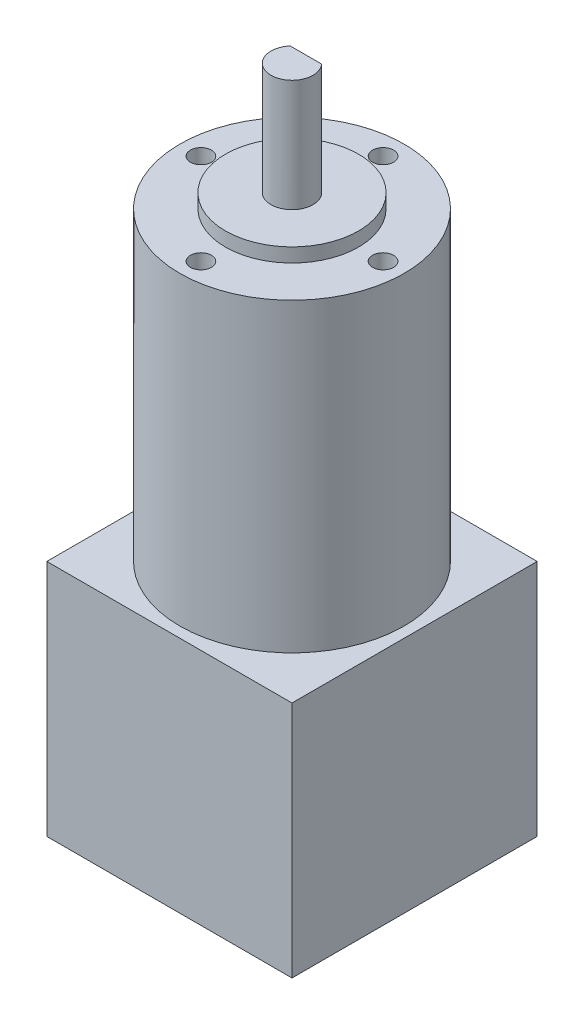
ISO-10303-21;
HEADER;
FILE_DESCRIPTION(('STEP AP214'),'2;1');
FILE_NAME('part.step','',(''),(''),'','','');
FILE_SCHEMA(('AUTOMOTIVE_DESIGN { 1 0 10303 214 1 1 1 1 }'));
ENDSEC;
DATA;
#1=APPLICATION_CONTEXT('core data for automotive mechanical design processes');
#2=APPLICATION_PROTOCOL_DEFINITION('international standard','automotive_design',2000,#1);
#3=PRODUCT_CONTEXT('',#1,'mechanical');
#4=PRODUCT('Part','Part','',(#3));
#5=PRODUCT_RELATED_PRODUCT_CATEGORY('part','',(#4));
#6=PRODUCT_DEFINITION_FORMATION('','',#4);
#7=PRODUCT_DEFINITION_CONTEXT('part definition',#1,'design');
#8=PRODUCT_DEFINITION('design','',#6,#7);
#9=PRODUCT_DEFINITION_SHAPE('','',#8);
#10=(LENGTH_UNIT() NAMED_UNIT(*) SI_UNIT(.MILLI.,.METRE.));
#11=(NAMED_UNIT(*) PLANE_ANGLE_UNIT() SI_UNIT($,.RADIAN.));
#12=(NAMED_UNIT(*) SI_UNIT($,.STERADIAN.) SOLID_ANGLE_UNIT());
#13=UNCERTAINTY_MEASURE_WITH_UNIT(LENGTH_MEASURE(1.E-05),#10,'distance_accuracy_value','');
#14=(GEOMETRIC_REPRESENTATION_CONTEXT(3) GLOBAL_UNCERTAINTY_ASSIGNED_CONTEXT((#13)) GLOBAL_UNIT_ASSIGNED_CONTEXT((#10,
#11,#12)) REPRESENTATION_CONTEXT('',''));
#15=CARTESIAN_POINT('',(0.,0.,0.));
#16=DIRECTION('',(0.,0.,1.));
#17=DIRECTION('',(1.,0.,0.));
#18=AXIS2_PLACEMENT_3D('',#15,#16,#17);
#19=CARTESIAN_POINT('',(17.5,34.,17.5));
#20=DIRECTION('',(-1.,0.,0.));
#21=DIRECTION('',(0.,0.,1.));
#22=AXIS2_PLACEMENT_3D('',#19,#20,#21);
#23=PLANE('',#22);
#24=DIRECTION('',(0.,0.,-1.));
#25=VECTOR('',#24,1.);
#26=CARTESIAN_POINT('',(17.5,0.,17.5));
#27=LINE('',#26,#25);
#28=CARTESIAN_POINT('',(17.5,0.,17.5));
#29=VERTEX_POINT('',#28);
#30=CARTESIAN_POINT('',(17.5,0.,-17.5));
#31=VERTEX_POINT('',#30);
#32=EDGE_CURVE('E142',#29,#31,#27,.T.);
#33=ORIENTED_EDGE('',*,*,#32,.T.);
#34=DIRECTION('',(0.,-1.,0.));
#35=VECTOR('',#34,1.);
#36=CARTESIAN_POINT('',(17.5,34.,-17.5));
#37=LINE('',#36,#35);
#38=CARTESIAN_POINT('',(17.5,34.,-17.5));
#39=VERTEX_POINT('',#38);
#40=EDGE_CURVE('E42',#39,#31,#37,.T.);
#41=ORIENTED_EDGE('',*,*,#40,.F.);
#42=DIRECTION('',(0.,0.,-1.));
#43=VECTOR('',#42,1.);
#44=CARTESIAN_POINT('',(17.5,34.,17.5));
#45=LINE('',#44,#43);
#46=CARTESIAN_POINT('',(17.5,34.,17.5));
#47=VERTEX_POINT('',#46);
#48=EDGE_CURVE('E146',#47,#39,#45,.T.);
#49=ORIENTED_EDGE('',*,*,#48,.F.);
#50=DIRECTION('',(0.,-1.,0.));
#51=VECTOR('',#50,1.);
#52=CARTESIAN_POINT('',(17.5,34.,17.5));
#53=LINE('',#52,#51);
#54=EDGE_CURVE('E156',#47,#29,#53,.T.);
#55=ORIENTED_EDGE('',*,*,#54,.T.);
#56=EDGE_LOOP('',(#33,#41,#49,#55));
#57=FACE_BOUND('',#56,.T.);
#58=ADVANCED_FACE('F39',(#57),#23,.F.);
#59=CARTESIAN_POINT('',(-17.5,34.,-17.5));
#60=DIRECTION('',(0.,0.,1.));
#61=DIRECTION('',(1.,0.,0.));
#62=AXIS2_PLACEMENT_3D('',#59,#60,#61);
#63=PLANE('',#62);
#64=DIRECTION('',(-1.,0.,0.));
#65=VECTOR('',#64,1.);
#66=CARTESIAN_POINT('',(-17.5,0.,-17.5));
#67=LINE('',#66,#65);
#68=CARTESIAN_POINT('',(-17.5,0.,-17.5));
#69=VERTEX_POINT('',#68);
#70=EDGE_CURVE('E160',#31,#69,#67,.T.);
#71=ORIENTED_EDGE('',*,*,#70,.T.);
#72=DIRECTION('',(0.,-1.,0.));
#73=VECTOR('',#72,1.);
#74=CARTESIAN_POINT('',(-17.5,34.,-17.5));
#75=LINE('',#74,#73);
#76=CARTESIAN_POINT('',(-17.5,34.,-17.5));
#77=VERTEX_POINT('',#76);
#78=EDGE_CURVE('E172',#77,#69,#75,.T.);
#79=ORIENTED_EDGE('',*,*,#78,.F.);
#80=DIRECTION('',(-1.,0.,0.));
#81=VECTOR('',#80,1.);
#82=CARTESIAN_POINT('',(-17.5,34.,-17.5));
#83=LINE('',#82,#81);
#84=EDGE_CURVE('E94',#39,#77,#83,.T.);
#85=ORIENTED_EDGE('',*,*,#84,.F.);
#86=ORIENTED_EDGE('',*,*,#40,.T.);
#87=EDGE_LOOP('',(#71,#79,#85,#86));
#88=FACE_BOUND('',#87,.T.);
#89=ADVANCED_FACE('F180',(#88),#63,.F.);
#90=CARTESIAN_POINT('',(-17.5,34.,17.5));
#91=DIRECTION('',(1.,0.,0.));
#92=DIRECTION('',(0.,0.,-1.));
#93=AXIS2_PLACEMENT_3D('',#90,#91,#92);
#94=PLANE('',#93);
#95=DIRECTION('',(0.,0.,1.));
#96=VECTOR('',#95,1.);
#97=CARTESIAN_POINT('',(-17.5,0.,17.5));
#98=LINE('',#97,#96);
#99=CARTESIAN_POINT('',(-17.5,0.,17.5));
#100=VERTEX_POINT('',#99);
#101=EDGE_CURVE('E163',#69,#100,#98,.T.);
#102=ORIENTED_EDGE('',*,*,#101,.T.);
#103=DIRECTION('',(0.,-1.,0.));
#104=VECTOR('',#103,1.);
#105=CARTESIAN_POINT('',(-17.5,34.,17.5));
#106=LINE('',#105,#104);
#107=CARTESIAN_POINT('',(-17.5,34.,17.5));
#108=VERTEX_POINT('',#107);
#109=EDGE_CURVE('E170',#108,#100,#106,.T.);
#110=ORIENTED_EDGE('',*,*,#109,.F.);
#111=DIRECTION('',(0.,0.,1.));
#112=VECTOR('',#111,1.);
#113=CARTESIAN_POINT('',(-17.5,34.,17.5));
#114=LINE('',#113,#112);
#115=EDGE_CURVE('E151',#77,#108,#114,.T.);
#116=ORIENTED_EDGE('',*,*,#115,.F.);
#117=ORIENTED_EDGE('',*,*,#78,.T.);
#118=EDGE_LOOP('',(#102,#110,#116,#117));
#119=FACE_BOUND('',#118,.T.);
#120=ADVANCED_FACE('F187',(#119),#94,.F.);
#121=CARTESIAN_POINT('',(-17.5,34.,17.5));
#122=DIRECTION('',(0.,0.,-1.));
#123=DIRECTION('',(-1.,0.,0.));
#124=AXIS2_PLACEMENT_3D('',#121,#122,#123);
#125=PLANE('',#124);
#126=DIRECTION('',(1.,0.,0.));
#127=VECTOR('',#126,1.);
#128=CARTESIAN_POINT('',(-17.5,0.,17.5));
#129=LINE('',#128,#127);
#130=EDGE_CURVE('E86',#100,#29,#129,.T.);
#131=ORIENTED_EDGE('',*,*,#130,.T.);
#132=ORIENTED_EDGE('',*,*,#54,.F.);
#133=DIRECTION('',(1.,0.,0.));
#134=VECTOR('',#133,1.);
#135=CARTESIAN_POINT('',(-17.5,34.,17.5));
#136=LINE('',#135,#134);
#137=EDGE_CURVE('E65',#108,#47,#136,.T.);
#138=ORIENTED_EDGE('',*,*,#137,.F.);
#139=ORIENTED_EDGE('',*,*,#109,.T.);
#140=EDGE_LOOP('',(#131,#132,#138,#139));
#141=FACE_BOUND('',#140,.T.);
#142=ADVANCED_FACE('F188',(#141),#125,.F.);
#143=CARTESIAN_POINT('',(0.,34.,0.));
#144=DIRECTION('',(0.,-1.,0.));
#145=DIRECTION('',(0.,0.,-1.));
#146=AXIS2_PLACEMENT_3D('',#143,#144,#145);
#147=PLANE('',#146);
#148=CARTESIAN_POINT('',(0.,34.,0.));
#149=DIRECTION('',(0.,1.,0.));
#150=DIRECTION('',(0.,0.,1.));
#151=AXIS2_PLACEMENT_3D('',#148,#149,#150);
#152=CIRCLE('',#151,16.);
#153=CARTESIAN_POINT('',(0.,34.,16.));
#154=VERTEX_POINT('',#153);
#155=EDGE_CURVE('E138',#154,#154,#152,.T.);
#156=ORIENTED_EDGE('',*,*,#155,.F.);
#157=EDGE_LOOP('',(#156));
#158=FACE_BOUND('',#157,.T.);
#159=ORIENTED_EDGE('',*,*,#48,.T.);
#160=ORIENTED_EDGE('',*,*,#84,.T.);
#161=ORIENTED_EDGE('',*,*,#115,.T.);
#162=ORIENTED_EDGE('',*,*,#137,.T.);
#163=EDGE_LOOP('',(#159,#160,#161,#162));
#164=FACE_BOUND('',#163,.T.);
#165=ADVANCED_FACE('F189',(#158,#164),#147,.F.);
#166=CARTESIAN_POINT('',(0.,0.,0.));
#167=DIRECTION('',(0.,-1.,0.));
#168=DIRECTION('',(0.,0.,-1.));
#169=AXIS2_PLACEMENT_3D('',#166,#167,#168);
#170=PLANE('',#169);
#171=ORIENTED_EDGE('',*,*,#32,.F.);
#172=ORIENTED_EDGE('',*,*,#130,.F.);
#173=ORIENTED_EDGE('',*,*,#101,.F.);
#174=ORIENTED_EDGE('',*,*,#70,.F.);
#175=EDGE_LOOP('',(#171,#172,#173,#174));
#176=FACE_BOUND('',#175,.T.);
#177=ADVANCED_FACE('F185',(#176),#170,.T.);
#178=CARTESIAN_POINT('',(0.,77.6,0.));
#179=DIRECTION('',(0.,-1.,0.));
#180=DIRECTION('',(0.,0.,-1.));
#181=AXIS2_PLACEMENT_3D('',#178,#179,#180);
#182=CYLINDRICAL_SURFACE('',#181,16.);
#183=CARTESIAN_POINT('',(0.,77.6,0.));
#184=DIRECTION('',(0.,1.,0.));
#185=DIRECTION('',(0.,0.,1.));
#186=AXIS2_PLACEMENT_3D('',#183,#184,#185);
#187=CIRCLE('',#186,16.);
#188=CARTESIAN_POINT('',(0.,77.6,16.));
#189=VERTEX_POINT('',#188);
#190=EDGE_CURVE('E134',#189,#189,#187,.T.);
#191=ORIENTED_EDGE('',*,*,#190,.F.);
#192=EDGE_LOOP('',(#191));
#193=FACE_BOUND('',#192,.T.);
#194=ORIENTED_EDGE('',*,*,#155,.T.);
#195=EDGE_LOOP('',(#194));
#196=FACE_BOUND('',#195,.T.);
#197=ADVANCED_FACE('F197',(#193,#196),#182,.T.);
#198=CARTESIAN_POINT('',(0.,77.6,0.));
#199=DIRECTION('',(0.,1.,0.));
#200=DIRECTION('',(0.,0.,1.));
#201=AXIS2_PLACEMENT_3D('',#198,#199,#200);
#202=PLANE('',#201);
#203=CARTESIAN_POINT('',(0.,77.6,-13.));
#204=DIRECTION('',(0.,1.,0.));
#205=DIRECTION('',(0.,0.,1.));
#206=AXIS2_PLACEMENT_3D('',#203,#204,#205);
#207=CIRCLE('',#206,1.5);
#208=CARTESIAN_POINT('',(0.,77.6,-11.5));
#209=VERTEX_POINT('',#208);
#210=EDGE_CURVE('E386',#209,#209,#207,.T.);
#211=ORIENTED_EDGE('',*,*,#210,.F.);
#212=EDGE_LOOP('',(#211));
#213=FACE_BOUND('',#212,.T.);
#214=CARTESIAN_POINT('',(13.,77.6,0.));
#215=DIRECTION('',(0.,1.,0.));
#216=DIRECTION('',(0.,0.,1.));
#217=AXIS2_PLACEMENT_3D('',#214,#215,#216);
#218=CIRCLE('',#217,1.5);
#219=CARTESIAN_POINT('',(13.,77.6,1.5));
#220=VERTEX_POINT('',#219);
#221=EDGE_CURVE('E397',#220,#220,#218,.T.);
#222=ORIENTED_EDGE('',*,*,#221,.F.);
#223=EDGE_LOOP('',(#222));
#224=FACE_BOUND('',#223,.T.);
#225=CARTESIAN_POINT('',(0.,77.6,13.));
#226=DIRECTION('',(0.,1.,0.));
#227=DIRECTION('',(0.,0.,1.));
#228=AXIS2_PLACEMENT_3D('',#225,#226,#227);
#229=CIRCLE('',#228,1.5);
#230=CARTESIAN_POINT('',(0.,77.6,14.5));
#231=VERTEX_POINT('',#230);
#232=EDGE_CURVE('E405',#231,#231,#229,.T.);
#233=ORIENTED_EDGE('',*,*,#232,.F.);
#234=EDGE_LOOP('',(#233));
#235=FACE_BOUND('',#234,.T.);
#236=CARTESIAN_POINT('',(-13.,77.6,0.));
#237=DIRECTION('',(0.,1.,0.));
#238=DIRECTION('',(0.,0.,1.));
#239=AXIS2_PLACEMENT_3D('',#236,#237,#238);
#240=CIRCLE('',#239,1.5);
#241=CARTESIAN_POINT('',(-13.,77.6,1.5));
#242=VERTEX_POINT('',#241);
#243=EDGE_CURVE('E413',#242,#242,#240,.T.);
#244=ORIENTED_EDGE('',*,*,#243,.F.);
#245=EDGE_LOOP('',(#244));
#246=FACE_BOUND('',#245,.T.);
#247=CARTESIAN_POINT('',(0.,77.6,0.));
#248=DIRECTION('',(0.,1.,0.));
#249=DIRECTION('',(0.,0.,1.));
#250=AXIS2_PLACEMENT_3D('',#247,#248,#249);
#251=CIRCLE('',#250,9.5);
#252=CARTESIAN_POINT('',(0.,77.6,9.5));
#253=VERTEX_POINT('',#252);
#254=EDGE_CURVE('E48',#253,#253,#251,.T.);
#255=ORIENTED_EDGE('',*,*,#254,.F.);
#256=EDGE_LOOP('',(#255));
#257=FACE_BOUND('',#256,.T.);
#258=ORIENTED_EDGE('',*,*,#190,.T.);
#259=EDGE_LOOP('',(#258));
#260=FACE_BOUND('',#259,.T.);
#261=ADVANCED_FACE('F235',(#213,#224,#235,#246,#257,#260),#202,.T.);
#262=CARTESIAN_POINT('',(0.,79.6,0.));
#263=DIRECTION('',(0.,-1.,0.));
#264=DIRECTION('',(0.,0.,-1.));
#265=AXIS2_PLACEMENT_3D('',#262,#263,#264);
#266=CYLINDRICAL_SURFACE('',#265,9.5);
#267=CARTESIAN_POINT('',(0.,79.6,0.));
#268=DIRECTION('',(0.,1.,0.));
#269=DIRECTION('',(0.,0.,1.));
#270=AXIS2_PLACEMENT_3D('',#267,#268,#269);
#271=CIRCLE('',#270,9.5);
#272=CARTESIAN_POINT('',(0.,79.6,9.5));
#273=VERTEX_POINT('',#272);
#274=EDGE_CURVE('E129',#273,#273,#271,.T.);
#275=ORIENTED_EDGE('',*,*,#274,.F.);
#276=EDGE_LOOP('',(#275));
#277=FACE_BOUND('',#276,.T.);
#278=ORIENTED_EDGE('',*,*,#254,.T.);
#279=EDGE_LOOP('',(#278));
#280=FACE_BOUND('',#279,.T.);
#281=ADVANCED_FACE('F242',(#277,#280),#266,.T.);
#282=CARTESIAN_POINT('',(0.,79.6,0.));
#283=DIRECTION('',(0.,1.,0.));
#284=DIRECTION('',(0.,0.,1.));
#285=AXIS2_PLACEMENT_3D('',#282,#283,#284);
#286=PLANE('',#285);
#287=CARTESIAN_POINT('',(0.,79.6,0.));
#288=DIRECTION('',(0.,1.,0.));
#289=DIRECTION('',(0.,0.,1.));
#290=AXIS2_PLACEMENT_3D('',#287,#288,#289);
#291=CIRCLE('',#290,3.);
#292=CARTESIAN_POINT('',(0.,79.6,3.));
#293=VERTEX_POINT('',#292);
#294=EDGE_CURVE('E11',#293,#293,#291,.T.);
#295=ORIENTED_EDGE('',*,*,#294,.F.);
#296=EDGE_LOOP('',(#295));
#297=FACE_BOUND('',#296,.T.);
#298=ORIENTED_EDGE('',*,*,#274,.T.);
#299=EDGE_LOOP('',(#298));
#300=FACE_BOUND('',#299,.T.);
#301=ADVANCED_FACE('F247',(#297,#300),#286,.T.);
#302=CARTESIAN_POINT('',(0.,95.6,0.));
#303=DIRECTION('',(0.,-1.,0.));
#304=DIRECTION('',(0.,0.,-1.));
#305=AXIS2_PLACEMENT_3D('',#302,#303,#304);
#306=CYLINDRICAL_SURFACE('',#305,3.);
#307=CARTESIAN_POINT('',(0.,95.6,0.));
#308=DIRECTION('',(0.,1.,0.));
#309=DIRECTION('',(0.,0.,1.));
#310=AXIS2_PLACEMENT_3D('',#307,#308,#309);
#311=CIRCLE('',#310,3.);
#312=CARTESIAN_POINT('',(-2.23606797749979,95.6,-2.));
#313=VERTEX_POINT('',#312);
#314=CARTESIAN_POINT('',(2.23606797749979,95.6,-2.));
#315=VERTEX_POINT('',#314);
#316=EDGE_CURVE('E121',#313,#315,#311,.T.);
#317=ORIENTED_EDGE('',*,*,#316,.F.);
#318=DIRECTION('',(0.,1.,0.));
#319=VECTOR('',#318,1.);
#320=CARTESIAN_POINT('',(-2.23606797749979,83.6,-2.));
#321=LINE('',#320,#319);
#322=CARTESIAN_POINT('',(-2.23606797749979,83.6,-2.));
#323=VERTEX_POINT('',#322);
#324=EDGE_CURVE('E56',#323,#313,#321,.T.);
#325=ORIENTED_EDGE('',*,*,#324,.F.);
#326=CARTESIAN_POINT('',(0.,83.6,0.));
#327=DIRECTION('',(0.,1.,0.));
#328=DIRECTION('',(0.,0.,1.));
#329=AXIS2_PLACEMENT_3D('',#326,#327,#328);
#330=CIRCLE('',#329,3.);
#331=CARTESIAN_POINT('',(2.23606797749979,83.6,-2.));
#332=VERTEX_POINT('',#331);
#333=EDGE_CURVE('E105',#332,#323,#330,.T.);
#334=ORIENTED_EDGE('',*,*,#333,.F.);
#335=DIRECTION('',(0.,1.,0.));
#336=VECTOR('',#335,1.);
#337=CARTESIAN_POINT('',(2.23606797749979,83.6,-2.));
#338=LINE('',#337,#336);
#339=EDGE_CURVE('E114',#332,#315,#338,.T.);
#340=ORIENTED_EDGE('',*,*,#339,.T.);
#341=EDGE_LOOP('',(#317,#325,#334,#340));
#342=FACE_BOUND('',#341,.T.);
#343=ORIENTED_EDGE('',*,*,#294,.T.);
#344=EDGE_LOOP('',(#343));
#345=FACE_BOUND('',#344,.T.);
#346=ADVANCED_FACE('F118',(#342,#345),#306,.T.);
#347=CARTESIAN_POINT('',(0.,95.6,0.));
#348=DIRECTION('',(0.,1.,0.));
#349=DIRECTION('',(0.,0.,1.));
#350=AXIS2_PLACEMENT_3D('',#347,#348,#349);
#351=PLANE('',#350);
#352=DIRECTION('',(1.,0.,0.));
#353=VECTOR('',#352,1.);
#354=CARTESIAN_POINT('',(2.23606797749979,95.6,-2.));
#355=LINE('',#354,#353);
#356=EDGE_CURVE('E111',#313,#315,#355,.T.);
#357=ORIENTED_EDGE('',*,*,#356,.F.);
#358=ORIENTED_EDGE('',*,*,#316,.T.);
#359=EDGE_LOOP('',(#357,#358));
#360=FACE_BOUND('',#359,.T.);
#361=ADVANCED_FACE('F266',(#360),#351,.T.);
#362=CARTESIAN_POINT('',(2.23606797749979,83.6,-2.));
#363=DIRECTION('',(0.,0.,1.));
#364=DIRECTION('',(1.,0.,0.));
#365=AXIS2_PLACEMENT_3D('',#362,#363,#364);
#366=PLANE('',#365);
#367=ORIENTED_EDGE('',*,*,#356,.T.);
#368=ORIENTED_EDGE('',*,*,#339,.F.);
#369=DIRECTION('',(1.,0.,0.));
#370=VECTOR('',#369,1.);
#371=CARTESIAN_POINT('',(2.23606797749979,83.6,-2.));
#372=LINE('',#371,#370);
#373=EDGE_CURVE('E107',#323,#332,#372,.T.);
#374=ORIENTED_EDGE('',*,*,#373,.F.);
#375=ORIENTED_EDGE('',*,*,#324,.T.);
#376=EDGE_LOOP('',(#367,#368,#374,#375));
#377=FACE_BOUND('',#376,.T.);
#378=ADVANCED_FACE('F113',(#377),#366,.F.);
#379=CARTESIAN_POINT('',(0.,83.6,0.));
#380=DIRECTION('',(0.,1.,0.));
#381=DIRECTION('',(0.,0.,1.));
#382=AXIS2_PLACEMENT_3D('',#379,#380,#381);
#383=PLANE('',#382);
#384=ORIENTED_EDGE('',*,*,#333,.T.);
#385=ORIENTED_EDGE('',*,*,#373,.T.);
#386=EDGE_LOOP('',(#384,#385));
#387=FACE_BOUND('',#386,.T.);
#388=ADVANCED_FACE('F106',(#387),#383,.T.);
#389=CARTESIAN_POINT('',(-13.,70.6,0.));
#390=DIRECTION('',(0.,1.,0.));
#391=DIRECTION('',(0.,0.,1.));
#392=AXIS2_PLACEMENT_3D('',#389,#390,#391);
#393=CYLINDRICAL_SURFACE('',#392,1.5);
#394=CARTESIAN_POINT('',(-13.,70.6,0.));
#395=DIRECTION('',(0.,1.,0.));
#396=DIRECTION('',(0.,0.,1.));
#397=AXIS2_PLACEMENT_3D('',#394,#395,#396);
#398=CIRCLE('',#397,1.5);
#399=CARTESIAN_POINT('',(-13.,70.6,1.5));
#400=VERTEX_POINT('',#399);
#401=EDGE_CURVE('E409',#400,#400,#398,.T.);
#402=ORIENTED_EDGE('',*,*,#401,.F.);
#403=EDGE_LOOP('',(#402));
#404=FACE_BOUND('',#403,.T.);
#405=ORIENTED_EDGE('',*,*,#243,.T.);
#406=EDGE_LOOP('',(#405));
#407=FACE_BOUND('',#406,.T.);
#408=ADVANCED_FACE('F292',(#404,#407),#393,.F.);
#409=CARTESIAN_POINT('',(-13.,70.6,0.));
#410=DIRECTION('',(0.,1.,0.));
#411=DIRECTION('',(0.,0.,1.));
#412=AXIS2_PLACEMENT_3D('',#409,#410,#411);
#413=PLANE('',#412);
#414=ORIENTED_EDGE('',*,*,#401,.T.);
#415=EDGE_LOOP('',(#414));
#416=FACE_BOUND('',#415,.T.);
#417=ADVANCED_FACE('F308',(#416),#413,.T.);
#418=CARTESIAN_POINT('',(0.,70.6,13.));
#419=DIRECTION('',(0.,1.,0.));
#420=DIRECTION('',(0.,0.,1.));
#421=AXIS2_PLACEMENT_3D('',#418,#419,#420);
#422=CYLINDRICAL_SURFACE('',#421,1.5);
#423=CARTESIAN_POINT('',(0.,70.6,13.));
#424=DIRECTION('',(0.,1.,0.));
#425=DIRECTION('',(0.,0.,1.));
#426=AXIS2_PLACEMENT_3D('',#423,#424,#425);
#427=CIRCLE('',#426,1.5);
#428=CARTESIAN_POINT('',(0.,70.6,14.5));
#429=VERTEX_POINT('',#428);
#430=EDGE_CURVE('E401',#429,#429,#427,.T.);
#431=ORIENTED_EDGE('',*,*,#430,.F.);
#432=EDGE_LOOP('',(#431));
#433=FACE_BOUND('',#432,.T.);
#434=ORIENTED_EDGE('',*,*,#232,.T.);
#435=EDGE_LOOP('',(#434));
#436=FACE_BOUND('',#435,.T.);
#437=ADVANCED_FACE('F318',(#433,#436),#422,.F.);
#438=CARTESIAN_POINT('',(0.,70.6,13.));
#439=DIRECTION('',(0.,1.,0.));
#440=DIRECTION('',(0.,0.,1.));
#441=AXIS2_PLACEMENT_3D('',#438,#439,#440);
#442=PLANE('',#441);
#443=ORIENTED_EDGE('',*,*,#430,.T.);
#444=EDGE_LOOP('',(#443));
#445=FACE_BOUND('',#444,.T.);
#446=ADVANCED_FACE('F328',(#445),#442,.T.);
#447=CARTESIAN_POINT('',(13.,70.6,0.));
#448=DIRECTION('',(0.,1.,0.));
#449=DIRECTION('',(0.,0.,1.));
#450=AXIS2_PLACEMENT_3D('',#447,#448,#449);
#451=CYLINDRICAL_SURFACE('',#450,1.5);
#452=CARTESIAN_POINT('',(13.,70.6,0.));
#453=DIRECTION('',(0.,1.,0.));
#454=DIRECTION('',(0.,0.,1.));
#455=AXIS2_PLACEMENT_3D('',#452,#453,#454);
#456=CIRCLE('',#455,1.5);
#457=CARTESIAN_POINT('',(13.,70.6,1.5));
#458=VERTEX_POINT('',#457);
#459=EDGE_CURVE('E391',#458,#458,#456,.T.);
#460=ORIENTED_EDGE('',*,*,#459,.F.);
#461=EDGE_LOOP('',(#460));
#462=FACE_BOUND('',#461,.T.);
#463=ORIENTED_EDGE('',*,*,#221,.T.);
#464=EDGE_LOOP('',(#463));
#465=FACE_BOUND('',#464,.T.);
#466=ADVANCED_FACE('F338',(#462,#465),#451,.F.);
#467=CARTESIAN_POINT('',(13.,70.6,0.));
#468=DIRECTION('',(0.,1.,0.));
#469=DIRECTION('',(0.,0.,1.));
#470=AXIS2_PLACEMENT_3D('',#467,#468,#469);
#471=PLANE('',#470);
#472=ORIENTED_EDGE('',*,*,#459,.T.);
#473=EDGE_LOOP('',(#472));
#474=FACE_BOUND('',#473,.T.);
#475=ADVANCED_FACE('F348',(#474),#471,.T.);
#476=CARTESIAN_POINT('',(0.,70.6,-13.));
#477=DIRECTION('',(0.,1.,0.));
#478=DIRECTION('',(0.,0.,1.));
#479=AXIS2_PLACEMENT_3D('',#476,#477,#478);
#480=CYLINDRICAL_SURFACE('',#479,1.5);
#481=CARTESIAN_POINT('',(0.,70.6,-13.));
#482=DIRECTION('',(0.,1.,0.));
#483=DIRECTION('',(0.,0.,1.));
#484=AXIS2_PLACEMENT_3D('',#481,#482,#483);
#485=CIRCLE('',#484,1.5);
#486=CARTESIAN_POINT('',(0.,70.6,-11.5));
#487=VERTEX_POINT('',#486);
#488=EDGE_CURVE('E384',#487,#487,#485,.T.);
#489=ORIENTED_EDGE('',*,*,#488,.F.);
#490=EDGE_LOOP('',(#489));
#491=FACE_BOUND('',#490,.T.);
#492=ORIENTED_EDGE('',*,*,#210,.T.);
#493=EDGE_LOOP('',(#492));
#494=FACE_BOUND('',#493,.T.);
#495=ADVANCED_FACE('F358',(#491,#494),#480,.F.);
#496=CARTESIAN_POINT('',(0.,70.6,-13.));
#497=DIRECTION('',(0.,1.,0.));
#498=DIRECTION('',(0.,0.,1.));
#499=AXIS2_PLACEMENT_3D('',#496,#497,#498);
#500=PLANE('',#499);
#501=ORIENTED_EDGE('',*,*,#488,.T.);
#502=EDGE_LOOP('',(#501));
#503=FACE_BOUND('',#502,.T.);
#504=ADVANCED_FACE('F368',(#503),#500,.T.);
#505=CLOSED_SHELL('',(#58,#89,#120,#142,#165,#177,#197,#261,#281,#301,#346,#361,#378,#388,#408,
#417,#437,#446,#466,#475,#495,#504));
#506=MANIFOLD_SOLID_BREP('B2',#505);
#507=ADVANCED_BREP_SHAPE_REPRESENTATION('',(#18,#506),#14);
#508=SHAPE_DEFINITION_REPRESENTATION(#9,#507);
ENDSEC;
END-ISO-10303-21;
